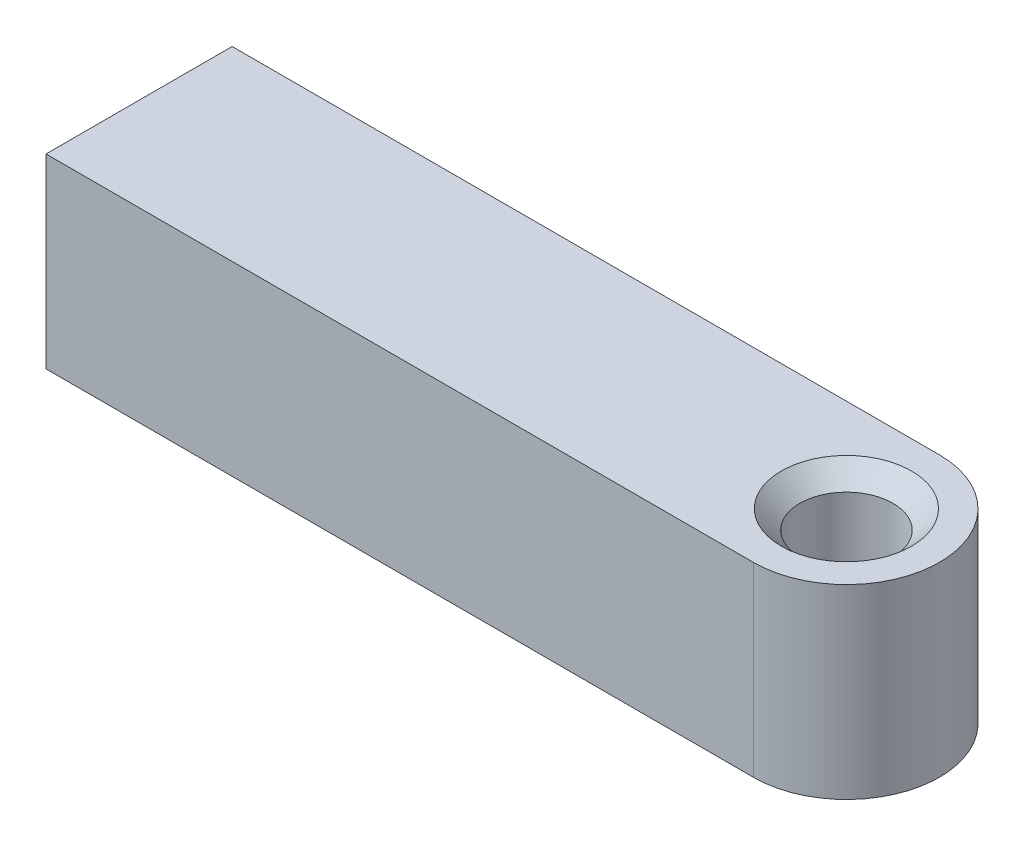
ISO-10303-21;
HEADER;
FILE_DESCRIPTION(('STEP AP214'),'2;1');
FILE_NAME('part.step','',(''),(''),'','','');
FILE_SCHEMA(('AUTOMOTIVE_DESIGN { 1 0 10303 214 1 1 1 1 }'));
ENDSEC;
DATA;
#1=APPLICATION_CONTEXT('core data for automotive mechanical design processes');
#2=APPLICATION_PROTOCOL_DEFINITION('international standard','automotive_design',2000,#1);
#3=PRODUCT_CONTEXT('',#1,'mechanical');
#4=PRODUCT('Part','Part','',(#3));
#5=PRODUCT_RELATED_PRODUCT_CATEGORY('part','',(#4));
#6=PRODUCT_DEFINITION_FORMATION('','',#4);
#7=PRODUCT_DEFINITION_CONTEXT('part definition',#1,'design');
#8=PRODUCT_DEFINITION('design','',#6,#7);
#9=PRODUCT_DEFINITION_SHAPE('','',#8);
#10=(LENGTH_UNIT() NAMED_UNIT(*) SI_UNIT(.MILLI.,.METRE.));
#11=(NAMED_UNIT(*) PLANE_ANGLE_UNIT() SI_UNIT($,.RADIAN.));
#12=(NAMED_UNIT(*) SI_UNIT($,.STERADIAN.) SOLID_ANGLE_UNIT());
#13=UNCERTAINTY_MEASURE_WITH_UNIT(LENGTH_MEASURE(1.E-05),#10,'distance_accuracy_value','');
#14=(GEOMETRIC_REPRESENTATION_CONTEXT(3) GLOBAL_UNCERTAINTY_ASSIGNED_CONTEXT((#13)) GLOBAL_UNIT_ASSIGNED_CONTEXT((#10,
#11,#12)) REPRESENTATION_CONTEXT('',''));
#15=CARTESIAN_POINT('',(0.,0.,0.));
#16=DIRECTION('',(0.,0.,1.));
#17=DIRECTION('',(1.,0.,0.));
#18=AXIS2_PLACEMENT_3D('',#15,#16,#17);
#19=CARTESIAN_POINT('',(0.,10.,0.));
#20=DIRECTION('',(0.,-1.,0.));
#21=DIRECTION('',(0.,0.,-1.));
#22=AXIS2_PLACEMENT_3D('',#19,#20,#21);
#23=CYLINDRICAL_SURFACE('',#22,5.);
#24=CARTESIAN_POINT('',(0.,0.,0.));
#25=DIRECTION('',(0.,1.,0.));
#26=DIRECTION('',(0.,0.,1.));
#27=AXIS2_PLACEMENT_3D('',#24,#25,#26);
#28=CIRCLE('',#27,5.);
#29=CARTESIAN_POINT('',(0.,0.,5.));
#30=VERTEX_POINT('',#29);
#31=CARTESIAN_POINT('',(0.,0.,-5.));
#32=VERTEX_POINT('',#31);
#33=EDGE_CURVE('E98',#30,#32,#28,.T.);
#34=ORIENTED_EDGE('',*,*,#33,.T.);
#35=DIRECTION('',(0.,-1.,0.));
#36=VECTOR('',#35,1.);
#37=CARTESIAN_POINT('',(0.,10.,-5.));
#38=LINE('',#37,#36);
#39=CARTESIAN_POINT('',(0.,10.,-5.));
#40=VERTEX_POINT('',#39);
#41=EDGE_CURVE('E11',#40,#32,#38,.T.);
#42=ORIENTED_EDGE('',*,*,#41,.F.);
#43=CARTESIAN_POINT('',(0.,10.,0.));
#44=DIRECTION('',(0.,1.,0.));
#45=DIRECTION('',(0.,0.,1.));
#46=AXIS2_PLACEMENT_3D('',#43,#44,#45);
#47=CIRCLE('',#46,5.);
#48=CARTESIAN_POINT('',(0.,10.,5.));
#49=VERTEX_POINT('',#48);
#50=EDGE_CURVE('E86',#49,#40,#47,.T.);
#51=ORIENTED_EDGE('',*,*,#50,.F.);
#52=DIRECTION('',(0.,-1.,0.));
#53=VECTOR('',#52,1.);
#54=CARTESIAN_POINT('',(0.,10.,5.));
#55=LINE('',#54,#53);
#56=EDGE_CURVE('E94',#49,#30,#55,.T.);
#57=ORIENTED_EDGE('',*,*,#56,.T.);
#58=EDGE_LOOP('',(#34,#42,#51,#57));
#59=FACE_BOUND('',#58,.T.);
#60=ADVANCED_FACE('F35',(#59),#23,.T.);
#61=CARTESIAN_POINT('',(0.,10.,-5.));
#62=DIRECTION('',(0.,0.,1.));
#63=DIRECTION('',(1.,0.,0.));
#64=AXIS2_PLACEMENT_3D('',#61,#62,#63);
#65=PLANE('',#64);
#66=DIRECTION('',(-1.,0.,0.));
#67=VECTOR('',#66,1.);
#68=CARTESIAN_POINT('',(0.,0.,-5.));
#69=LINE('',#68,#67);
#70=CARTESIAN_POINT('',(-38.,0.,-5.));
#71=VERTEX_POINT('',#70);
#72=EDGE_CURVE('E90',#32,#71,#69,.T.);
#73=ORIENTED_EDGE('',*,*,#72,.T.);
#74=DIRECTION('',(0.,-1.,0.));
#75=VECTOR('',#74,1.);
#76=CARTESIAN_POINT('',(-38.,10.,-5.));
#77=LINE('',#76,#75);
#78=CARTESIAN_POINT('',(-38.,10.,-5.));
#79=VERTEX_POINT('',#78);
#80=EDGE_CURVE('E43',#79,#71,#77,.T.);
#81=ORIENTED_EDGE('',*,*,#80,.F.);
#82=DIRECTION('',(-1.,0.,0.));
#83=VECTOR('',#82,1.);
#84=CARTESIAN_POINT('',(0.,10.,-5.));
#85=LINE('',#84,#83);
#86=EDGE_CURVE('E81',#40,#79,#85,.T.);
#87=ORIENTED_EDGE('',*,*,#86,.F.);
#88=ORIENTED_EDGE('',*,*,#41,.T.);
#89=EDGE_LOOP('',(#73,#81,#87,#88));
#90=FACE_BOUND('',#89,.T.);
#91=ADVANCED_FACE('F89',(#90),#65,.F.);
#92=CARTESIAN_POINT('',(-38.,10.,5.));
#93=DIRECTION('',(1.,0.,0.));
#94=DIRECTION('',(0.,0.,-1.));
#95=AXIS2_PLACEMENT_3D('',#92,#93,#94);
#96=PLANE('',#95);
#97=DIRECTION('',(0.,0.,1.));
#98=VECTOR('',#97,1.);
#99=CARTESIAN_POINT('',(-38.,0.,5.));
#100=LINE('',#99,#98);
#101=CARTESIAN_POINT('',(-38.,0.,5.));
#102=VERTEX_POINT('',#101);
#103=EDGE_CURVE('E68',#71,#102,#100,.T.);
#104=ORIENTED_EDGE('',*,*,#103,.T.);
#105=DIRECTION('',(0.,-1.,0.));
#106=VECTOR('',#105,1.);
#107=CARTESIAN_POINT('',(-38.,10.,5.));
#108=LINE('',#107,#106);
#109=CARTESIAN_POINT('',(-38.,10.,5.));
#110=VERTEX_POINT('',#109);
#111=EDGE_CURVE('E91',#110,#102,#108,.T.);
#112=ORIENTED_EDGE('',*,*,#111,.F.);
#113=DIRECTION('',(0.,0.,1.));
#114=VECTOR('',#113,1.);
#115=CARTESIAN_POINT('',(-38.,10.,5.));
#116=LINE('',#115,#114);
#117=EDGE_CURVE('E84',#79,#110,#116,.T.);
#118=ORIENTED_EDGE('',*,*,#117,.F.);
#119=ORIENTED_EDGE('',*,*,#80,.T.);
#120=EDGE_LOOP('',(#104,#112,#118,#119));
#121=FACE_BOUND('',#120,.T.);
#122=ADVANCED_FACE('F92',(#121),#96,.F.);
#123=CARTESIAN_POINT('',(0.,10.,5.));
#124=DIRECTION('',(0.,0.,-1.));
#125=DIRECTION('',(-1.,0.,0.));
#126=AXIS2_PLACEMENT_3D('',#123,#124,#125);
#127=PLANE('',#126);
#128=DIRECTION('',(1.,0.,0.));
#129=VECTOR('',#128,1.);
#130=CARTESIAN_POINT('',(0.,0.,5.));
#131=LINE('',#130,#129);
#132=EDGE_CURVE('E74',#102,#30,#131,.T.);
#133=ORIENTED_EDGE('',*,*,#132,.T.);
#134=ORIENTED_EDGE('',*,*,#56,.F.);
#135=DIRECTION('',(1.,0.,0.));
#136=VECTOR('',#135,1.);
#137=CARTESIAN_POINT('',(0.,10.,5.));
#138=LINE('',#137,#136);
#139=EDGE_CURVE('E51',#110,#49,#138,.T.);
#140=ORIENTED_EDGE('',*,*,#139,.F.);
#141=ORIENTED_EDGE('',*,*,#111,.T.);
#142=EDGE_LOOP('',(#133,#134,#140,#141));
#143=FACE_BOUND('',#142,.T.);
#144=ADVANCED_FACE('F106',(#143),#127,.F.);
#145=CARTESIAN_POINT('',(0.,10.,0.));
#146=DIRECTION('',(0.,1.,0.));
#147=DIRECTION('',(0.,0.,1.));
#148=AXIS2_PLACEMENT_3D('',#145,#146,#147);
#149=PLANE('',#148);
#150=CARTESIAN_POINT('',(0.,10.,0.));
#151=DIRECTION('',(0.,1.,0.));
#152=DIRECTION('',(0.,0.,1.));
#153=AXIS2_PLACEMENT_3D('',#150,#151,#152);
#154=CIRCLE('',#153,3.5);
#155=CARTESIAN_POINT('',(0.,10.,3.5));
#156=VERTEX_POINT('',#155);
#157=EDGE_CURVE('E117',#156,#156,#154,.T.);
#158=ORIENTED_EDGE('',*,*,#157,.F.);
#159=EDGE_LOOP('',(#158));
#160=FACE_BOUND('',#159,.T.);
#161=ORIENTED_EDGE('',*,*,#50,.T.);
#162=ORIENTED_EDGE('',*,*,#86,.T.);
#163=ORIENTED_EDGE('',*,*,#117,.T.);
#164=ORIENTED_EDGE('',*,*,#139,.T.);
#165=EDGE_LOOP('',(#161,#162,#163,#164));
#166=FACE_BOUND('',#165,.T.);
#167=ADVANCED_FACE('F82',(#160,#166),#149,.T.);
#168=CARTESIAN_POINT('',(0.,0.,0.));
#169=DIRECTION('',(0.,1.,0.));
#170=DIRECTION('',(0.,0.,1.));
#171=AXIS2_PLACEMENT_3D('',#168,#169,#170);
#172=PLANE('',#171);
#173=CARTESIAN_POINT('',(0.,0.,0.));
#174=DIRECTION('',(0.,1.,0.));
#175=DIRECTION('',(0.,0.,1.));
#176=AXIS2_PLACEMENT_3D('',#173,#174,#175);
#177=CIRCLE('',#176,3.5);
#178=CARTESIAN_POINT('',(0.,0.,3.5));
#179=VERTEX_POINT('',#178);
#180=EDGE_CURVE('E120',#179,#179,#177,.T.);
#181=ORIENTED_EDGE('',*,*,#180,.T.);
#182=EDGE_LOOP('',(#181));
#183=FACE_BOUND('',#182,.T.);
#184=ORIENTED_EDGE('',*,*,#33,.F.);
#185=ORIENTED_EDGE('',*,*,#132,.F.);
#186=ORIENTED_EDGE('',*,*,#103,.F.);
#187=ORIENTED_EDGE('',*,*,#72,.F.);
#188=EDGE_LOOP('',(#184,#185,#186,#187));
#189=FACE_BOUND('',#188,.T.);
#190=ADVANCED_FACE('F109',(#183,#189),#172,.F.);
#191=CARTESIAN_POINT('',(0.,1.,0.));
#192=DIRECTION('',(0.,-1.,0.));
#193=DIRECTION('',(0.,0.,-1.));
#194=AXIS2_PLACEMENT_3D('',#191,#192,#193);
#195=CONICAL_SURFACE('',#194,2.5,0.785398163397448);
#196=ORIENTED_EDGE('',*,*,#180,.F.);
#197=EDGE_LOOP('',(#196));
#198=FACE_BOUND('',#197,.T.);
#199=CARTESIAN_POINT('',(0.,1.,0.));
#200=DIRECTION('',(0.,1.,0.));
#201=DIRECTION('',(0.,0.,1.));
#202=AXIS2_PLACEMENT_3D('',#199,#200,#201);
#203=CIRCLE('',#202,2.5);
#204=CARTESIAN_POINT('',(0.,1.,2.5));
#205=VERTEX_POINT('',#204);
#206=EDGE_CURVE('E101',#205,#205,#203,.T.);
#207=ORIENTED_EDGE('',*,*,#206,.T.);
#208=EDGE_LOOP('',(#207));
#209=FACE_BOUND('',#208,.T.);
#210=ADVANCED_FACE('F125',(#198,#209),#195,.F.);
#211=CARTESIAN_POINT('',(0.,10.,0.));
#212=DIRECTION('',(0.,1.,0.));
#213=DIRECTION('',(0.,0.,1.));
#214=AXIS2_PLACEMENT_3D('',#211,#212,#213);
#215=CYLINDRICAL_SURFACE('',#214,2.49999999999999);
#216=ORIENTED_EDGE('',*,*,#206,.F.);
#217=EDGE_LOOP('',(#216));
#218=FACE_BOUND('',#217,.T.);
#219=CARTESIAN_POINT('',(0.,8.99999999999997,0.));
#220=DIRECTION('',(0.,1.,0.));
#221=DIRECTION('',(0.,0.,1.));
#222=AXIS2_PLACEMENT_3D('',#219,#220,#221);
#223=CIRCLE('',#222,2.49999999999999);
#224=CARTESIAN_POINT('',(0.,8.99999999999997,2.49999999999999));
#225=VERTEX_POINT('',#224);
#226=EDGE_CURVE('E114',#225,#225,#223,.T.);
#227=ORIENTED_EDGE('',*,*,#226,.T.);
#228=EDGE_LOOP('',(#227));
#229=FACE_BOUND('',#228,.T.);
#230=ADVANCED_FACE('F128',(#218,#229),#215,.F.);
#231=CARTESIAN_POINT('',(0.,10.,0.));
#232=DIRECTION('',(0.,1.,0.));
#233=DIRECTION('',(0.,0.,1.));
#234=AXIS2_PLACEMENT_3D('',#231,#232,#233);
#235=CONICAL_SURFACE('',#234,3.5,0.785398163397439);
#236=ORIENTED_EDGE('',*,*,#226,.F.);
#237=EDGE_LOOP('',(#236));
#238=FACE_BOUND('',#237,.T.);
#239=ORIENTED_EDGE('',*,*,#157,.T.);
#240=EDGE_LOOP('',(#239));
#241=FACE_BOUND('',#240,.T.);
#242=ADVANCED_FACE('F134',(#238,#241),#235,.F.);
#243=CLOSED_SHELL('',(#60,#91,#122,#144,#167,#190,#210,#230,#242));
#244=MANIFOLD_SOLID_BREP('B2',#243);
#245=ADVANCED_BREP_SHAPE_REPRESENTATION('',(#18,#244),#14);
#246=SHAPE_DEFINITION_REPRESENTATION(#9,#245);
ENDSEC;
END-ISO-10303-21;
